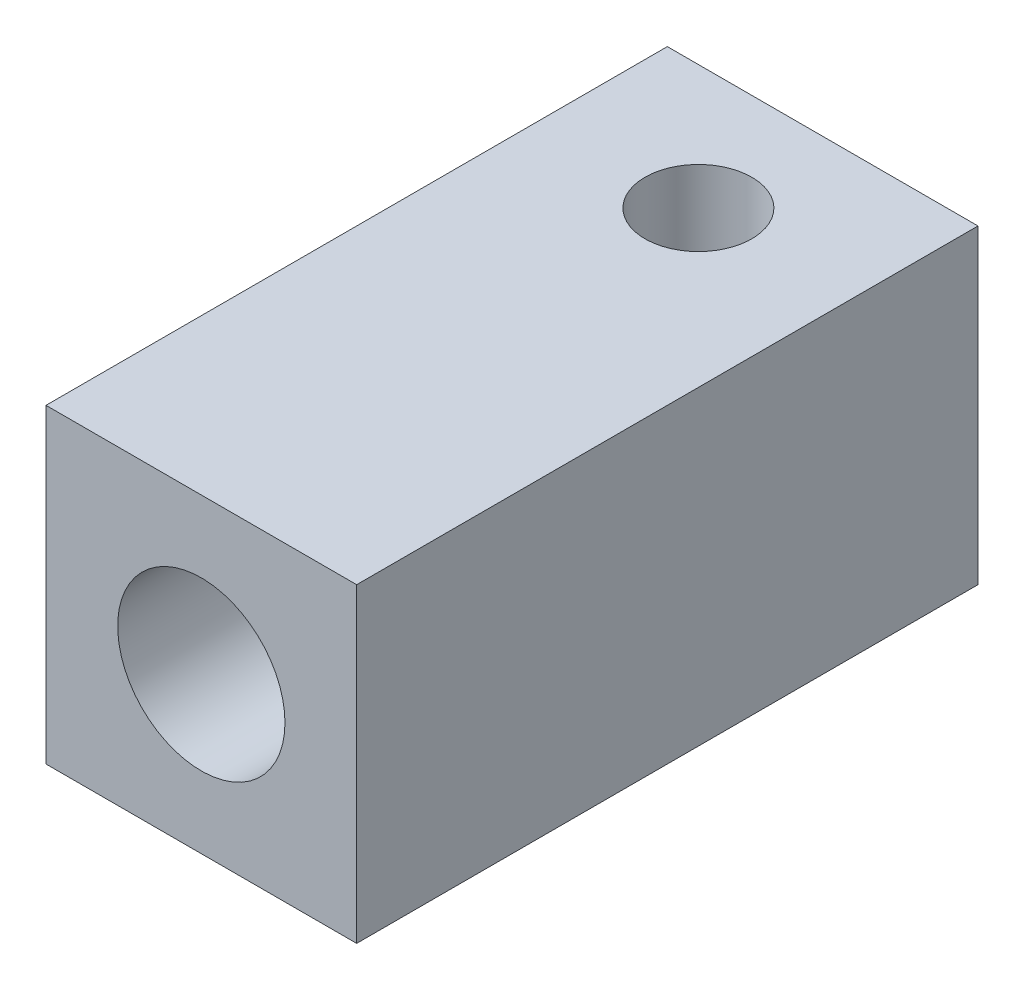
ISO-10303-21;
HEADER;
FILE_DESCRIPTION(('STEP AP214'),'2;1');
FILE_NAME('part.step','',(''),(''),'','','');
FILE_SCHEMA(('AUTOMOTIVE_DESIGN { 1 0 10303 214 1 1 1 1 }'));
ENDSEC;
DATA;
#1=APPLICATION_CONTEXT('core data for automotive mechanical design processes');
#2=APPLICATION_PROTOCOL_DEFINITION('international standard','automotive_design',2000,#1);
#3=PRODUCT_CONTEXT('',#1,'mechanical');
#4=PRODUCT('Part','Part','',(#3));
#5=PRODUCT_RELATED_PRODUCT_CATEGORY('part','',(#4));
#6=PRODUCT_DEFINITION_FORMATION('','',#4);
#7=PRODUCT_DEFINITION_CONTEXT('part definition',#1,'design');
#8=PRODUCT_DEFINITION('design','',#6,#7);
#9=PRODUCT_DEFINITION_SHAPE('','',#8);
#10=(LENGTH_UNIT() NAMED_UNIT(*) SI_UNIT(.MILLI.,.METRE.));
#11=(NAMED_UNIT(*) PLANE_ANGLE_UNIT() SI_UNIT($,.RADIAN.));
#12=(NAMED_UNIT(*) SI_UNIT($,.STERADIAN.) SOLID_ANGLE_UNIT());
#13=UNCERTAINTY_MEASURE_WITH_UNIT(LENGTH_MEASURE(1.E-05),#10,'distance_accuracy_value','');
#14=(GEOMETRIC_REPRESENTATION_CONTEXT(3) GLOBAL_UNCERTAINTY_ASSIGNED_CONTEXT((#13)) GLOBAL_UNIT_ASSIGNED_CONTEXT((#10,
#11,#12)) REPRESENTATION_CONTEXT('',''));
#15=CARTESIAN_POINT('',(0.,0.,0.));
#16=DIRECTION('',(0.,0.,1.));
#17=DIRECTION('',(1.,0.,0.));
#18=AXIS2_PLACEMENT_3D('',#15,#16,#17);
#19=CARTESIAN_POINT('',(-4.66304347826087,0.989130434782609,15.));
#20=DIRECTION('',(0.,0.,-1.));
#21=DIRECTION('',(-1.,0.,0.));
#22=AXIS2_PLACEMENT_3D('',#19,#20,#21);
#23=CYLINDRICAL_SURFACE('',#22,1.1);
#24=CARTESIAN_POINT('',(-4.66304347826087,0.989130434782609,0.));
#25=DIRECTION('',(0.,0.,-1.));
#26=DIRECTION('',(-1.,0.,0.));
#27=AXIS2_PLACEMENT_3D('',#24,#25,#26);
#28=CIRCLE('',#27,1.1);
#29=CARTESIAN_POINT('',(-5.76304347826087,0.989130434782609,0.));
#30=VERTEX_POINT('',#29);
#31=EDGE_CURVE('E102',#30,#30,#28,.T.);
#32=ORIENTED_EDGE('',*,*,#31,.T.);
#33=EDGE_LOOP('',(#32));
#34=FACE_BOUND('',#33,.T.);
#35=CARTESIAN_POINT('',(-4.66304347826087,0.989130434782609,7.5));
#36=DIRECTION('',(0.,0.,1.));
#37=DIRECTION('',(1.,0.,0.));
#38=AXIS2_PLACEMENT_3D('',#35,#36,#37);
#39=CIRCLE('',#38,1.1);
#40=CARTESIAN_POINT('',(-3.56304347826087,0.989130434782609,7.5));
#41=VERTEX_POINT('',#40);
#42=EDGE_CURVE('E37',#41,#41,#39,.F.);
#43=ORIENTED_EDGE('',*,*,#42,.F.);
#44=EDGE_LOOP('',(#43));
#45=FACE_BOUND('',#44,.T.);
#46=ADVANCED_FACE('F33',(#34,#45),#23,.F.);
#47=CARTESIAN_POINT('',(-8.41304347826087,4.73913043478261,15.));
#48=DIRECTION('',(1.,0.,0.));
#49=DIRECTION('',(0.,0.,-1.));
#50=AXIS2_PLACEMENT_3D('',#47,#48,#49);
#51=PLANE('',#50);
#52=DIRECTION('',(0.,-1.,0.));
#53=VECTOR('',#52,1.);
#54=CARTESIAN_POINT('',(-8.41304347826087,4.73913043478261,0.));
#55=LINE('',#54,#53);
#56=CARTESIAN_POINT('',(-8.41304347826087,4.73913043478261,0.));
#57=VERTEX_POINT('',#56);
#58=CARTESIAN_POINT('',(-8.41304347826087,-2.76086956521739,0.));
#59=VERTEX_POINT('',#58);
#60=EDGE_CURVE('E99',#57,#59,#55,.T.);
#61=ORIENTED_EDGE('',*,*,#60,.T.);
#62=DIRECTION('',(0.,0.,-1.));
#63=VECTOR('',#62,1.);
#64=CARTESIAN_POINT('',(-8.41304347826087,-2.76086956521739,15.));
#65=LINE('',#64,#63);
#66=CARTESIAN_POINT('',(-8.41304347826087,-2.76086956521739,15.));
#67=VERTEX_POINT('',#66);
#68=EDGE_CURVE('E11',#67,#59,#65,.T.);
#69=ORIENTED_EDGE('',*,*,#68,.F.);
#70=DIRECTION('',(0.,-1.,0.));
#71=VECTOR('',#70,1.);
#72=CARTESIAN_POINT('',(-8.41304347826087,4.73913043478261,15.));
#73=LINE('',#72,#71);
#74=CARTESIAN_POINT('',(-8.41304347826087,4.73913043478261,15.));
#75=VERTEX_POINT('',#74);
#76=EDGE_CURVE('E86',#75,#67,#73,.T.);
#77=ORIENTED_EDGE('',*,*,#76,.F.);
#78=DIRECTION('',(0.,0.,-1.));
#79=VECTOR('',#78,1.);
#80=CARTESIAN_POINT('',(-8.41304347826087,4.73913043478261,15.));
#81=LINE('',#80,#79);
#82=EDGE_CURVE('E95',#75,#57,#81,.T.);
#83=ORIENTED_EDGE('',*,*,#82,.T.);
#84=EDGE_LOOP('',(#61,#69,#77,#83));
#85=FACE_BOUND('',#84,.T.);
#86=ADVANCED_FACE('F35',(#85),#51,.F.);
#87=CARTESIAN_POINT('',(-8.41304347826087,-2.76086956521739,15.));
#88=DIRECTION('',(0.,1.,0.));
#89=DIRECTION('',(0.,0.,1.));
#90=AXIS2_PLACEMENT_3D('',#87,#88,#89);
#91=PLANE('',#90);
#92=DIRECTION('',(1.,0.,0.));
#93=VECTOR('',#92,1.);
#94=CARTESIAN_POINT('',(-8.41304347826087,-2.76086956521739,0.));
#95=LINE('',#94,#93);
#96=CARTESIAN_POINT('',(-0.913043478260869,-2.76086956521739,0.));
#97=VERTEX_POINT('',#96);
#98=EDGE_CURVE('E90',#59,#97,#95,.T.);
#99=ORIENTED_EDGE('',*,*,#98,.T.);
#100=DIRECTION('',(0.,0.,-1.));
#101=VECTOR('',#100,1.);
#102=CARTESIAN_POINT('',(-0.913043478260869,-2.76086956521739,15.));
#103=LINE('',#102,#101);
#104=CARTESIAN_POINT('',(-0.913043478260869,-2.76086956521739,15.));
#105=VERTEX_POINT('',#104);
#106=EDGE_CURVE('E43',#105,#97,#103,.T.);
#107=ORIENTED_EDGE('',*,*,#106,.F.);
#108=DIRECTION('',(1.,0.,0.));
#109=VECTOR('',#108,1.);
#110=CARTESIAN_POINT('',(-8.41304347826087,-2.76086956521739,15.));
#111=LINE('',#110,#109);
#112=EDGE_CURVE('E81',#67,#105,#111,.T.);
#113=ORIENTED_EDGE('',*,*,#112,.F.);
#114=ORIENTED_EDGE('',*,*,#68,.T.);
#115=EDGE_LOOP('',(#99,#107,#113,#114));
#116=FACE_BOUND('',#115,.T.);
#117=ADVANCED_FACE('F89',(#116),#91,.F.);
#118=CARTESIAN_POINT('',(-0.913043478260869,4.73913043478261,15.));
#119=DIRECTION('',(-1.,0.,0.));
#120=DIRECTION('',(0.,-1.,0.));
#121=AXIS2_PLACEMENT_3D('',#118,#119,#120);
#122=PLANE('',#121);
#123=DIRECTION('',(0.,1.,0.));
#124=VECTOR('',#123,1.);
#125=CARTESIAN_POINT('',(-0.913043478260869,4.73913043478261,0.));
#126=LINE('',#125,#124);
#127=CARTESIAN_POINT('',(-0.913043478260869,4.73913043478261,0.));
#128=VERTEX_POINT('',#127);
#129=EDGE_CURVE('E68',#97,#128,#126,.T.);
#130=ORIENTED_EDGE('',*,*,#129,.T.);
#131=DIRECTION('',(0.,0.,-1.));
#132=VECTOR('',#131,1.);
#133=CARTESIAN_POINT('',(-0.913043478260869,4.73913043478261,15.));
#134=LINE('',#133,#132);
#135=CARTESIAN_POINT('',(-0.913043478260869,4.73913043478261,15.));
#136=VERTEX_POINT('',#135);
#137=EDGE_CURVE('E91',#136,#128,#134,.T.);
#138=ORIENTED_EDGE('',*,*,#137,.F.);
#139=DIRECTION('',(0.,1.,0.));
#140=VECTOR('',#139,1.);
#141=CARTESIAN_POINT('',(-0.913043478260869,4.73913043478261,15.));
#142=LINE('',#141,#140);
#143=EDGE_CURVE('E84',#105,#136,#142,.T.);
#144=ORIENTED_EDGE('',*,*,#143,.F.);
#145=ORIENTED_EDGE('',*,*,#106,.T.);
#146=EDGE_LOOP('',(#130,#138,#144,#145));
#147=FACE_BOUND('',#146,.T.);
#148=ADVANCED_FACE('F93',(#147),#122,.F.);
#149=CARTESIAN_POINT('',(-8.41304347826087,4.73913043478261,15.));
#150=DIRECTION('',(0.,-1.,0.));
#151=DIRECTION('',(0.,0.,-1.));
#152=AXIS2_PLACEMENT_3D('',#149,#150,#151);
#153=PLANE('',#152);
#154=CARTESIAN_POINT('',(-4.66304347826087,4.73913043478261,3.));
#155=DIRECTION('',(0.,1.,0.));
#156=DIRECTION('',(-1.,0.,0.));
#157=AXIS2_PLACEMENT_3D('',#154,#155,#156);
#158=CIRCLE('',#157,1.28905);
#159=CARTESIAN_POINT('',(-5.95209347826087,4.73913043478261,3.));
#160=VERTEX_POINT('',#159);
#161=EDGE_CURVE('E122',#160,#160,#158,.T.);
#162=ORIENTED_EDGE('',*,*,#161,.F.);
#163=EDGE_LOOP('',(#162));
#164=FACE_BOUND('',#163,.T.);
#165=DIRECTION('',(-1.,0.,0.));
#166=VECTOR('',#165,1.);
#167=CARTESIAN_POINT('',(-8.41304347826087,4.73913043478261,0.));
#168=LINE('',#167,#166);
#169=EDGE_CURVE('E74',#128,#57,#168,.T.);
#170=ORIENTED_EDGE('',*,*,#169,.T.);
#171=ORIENTED_EDGE('',*,*,#82,.F.);
#172=DIRECTION('',(-1.,0.,0.));
#173=VECTOR('',#172,1.);
#174=CARTESIAN_POINT('',(-8.41304347826087,4.73913043478261,15.));
#175=LINE('',#174,#173);
#176=EDGE_CURVE('E51',#136,#75,#175,.T.);
#177=ORIENTED_EDGE('',*,*,#176,.F.);
#178=ORIENTED_EDGE('',*,*,#137,.T.);
#179=EDGE_LOOP('',(#170,#171,#177,#178));
#180=FACE_BOUND('',#179,.T.);
#181=ADVANCED_FACE('F107',(#164,#180),#153,.F.);
#182=CARTESIAN_POINT('',(0.,0.,15.));
#183=DIRECTION('',(0.,0.,1.));
#184=DIRECTION('',(1.,0.,0.));
#185=AXIS2_PLACEMENT_3D('',#182,#183,#184);
#186=PLANE('',#185);
#187=CARTESIAN_POINT('',(-4.66304347826087,0.989130434782609,15.));
#188=DIRECTION('',(0.,0.,1.));
#189=DIRECTION('',(1.,0.,0.));
#190=AXIS2_PLACEMENT_3D('',#187,#188,#189);
#191=CIRCLE('',#190,2.0193);
#192=CARTESIAN_POINT('',(-2.64374347826087,0.989130434782609,15.));
#193=VERTEX_POINT('',#192);
#194=EDGE_CURVE('E115',#193,#193,#191,.T.);
#195=ORIENTED_EDGE('',*,*,#194,.F.);
#196=EDGE_LOOP('',(#195));
#197=FACE_BOUND('',#196,.T.);
#198=ORIENTED_EDGE('',*,*,#76,.T.);
#199=ORIENTED_EDGE('',*,*,#112,.T.);
#200=ORIENTED_EDGE('',*,*,#143,.T.);
#201=ORIENTED_EDGE('',*,*,#176,.T.);
#202=EDGE_LOOP('',(#198,#199,#200,#201));
#203=FACE_BOUND('',#202,.T.);
#204=ADVANCED_FACE('F82',(#197,#203),#186,.T.);
#205=CARTESIAN_POINT('',(0.,0.,0.));
#206=DIRECTION('',(0.,0.,1.));
#207=DIRECTION('',(1.,0.,0.));
#208=AXIS2_PLACEMENT_3D('',#205,#206,#207);
#209=PLANE('',#208);
#210=ORIENTED_EDGE('',*,*,#31,.F.);
#211=EDGE_LOOP('',(#210));
#212=FACE_BOUND('',#211,.T.);
#213=ORIENTED_EDGE('',*,*,#60,.F.);
#214=ORIENTED_EDGE('',*,*,#169,.F.);
#215=ORIENTED_EDGE('',*,*,#129,.F.);
#216=ORIENTED_EDGE('',*,*,#98,.F.);
#217=EDGE_LOOP('',(#213,#214,#215,#216));
#218=FACE_BOUND('',#217,.T.);
#219=ADVANCED_FACE('F110',(#212,#218),#209,.F.);
#220=CARTESIAN_POINT('',(-4.66304347826087,0.989130434782609,7.5));
#221=DIRECTION('',(0.,0.,1.));
#222=DIRECTION('',(1.,0.,0.));
#223=AXIS2_PLACEMENT_3D('',#220,#221,#222);
#224=PLANE('',#223);
#225=CARTESIAN_POINT('',(-4.66304347826087,0.989130434782609,7.5));
#226=DIRECTION('',(0.,0.,1.));
#227=DIRECTION('',(1.,0.,0.));
#228=AXIS2_PLACEMENT_3D('',#225,#226,#227);
#229=CIRCLE('',#228,2.0193);
#230=CARTESIAN_POINT('',(-2.64374347826087,0.989130434782609,7.5));
#231=VERTEX_POINT('',#230);
#232=EDGE_CURVE('E118',#231,#231,#229,.T.);
#233=ORIENTED_EDGE('',*,*,#232,.T.);
#234=EDGE_LOOP('',(#233));
#235=FACE_BOUND('',#234,.T.);
#236=ORIENTED_EDGE('',*,*,#42,.T.);
#237=EDGE_LOOP('',(#236));
#238=FACE_BOUND('',#237,.T.);
#239=ADVANCED_FACE('F157',(#235,#238),#224,.T.);
#240=CARTESIAN_POINT('',(-4.66304347826087,0.989130434782609,7.5));
#241=DIRECTION('',(0.,0.,1.));
#242=DIRECTION('',(1.,0.,0.));
#243=AXIS2_PLACEMENT_3D('',#240,#241,#242);
#244=CYLINDRICAL_SURFACE('',#243,2.0193);
#245=ORIENTED_EDGE('',*,*,#232,.F.);
#246=EDGE_LOOP('',(#245));
#247=FACE_BOUND('',#246,.T.);
#248=ORIENTED_EDGE('',*,*,#194,.T.);
#249=EDGE_LOOP('',(#248));
#250=FACE_BOUND('',#249,.T.);
#251=ADVANCED_FACE('F133',(#247,#250),#244,.F.);
#252=CARTESIAN_POINT('',(-4.66304347826087,2.73913043478261,3.));
#253=DIRECTION('',(0.,1.,0.));
#254=DIRECTION('',(-1.,0.,0.));
#255=AXIS2_PLACEMENT_3D('',#252,#253,#254);
#256=CYLINDRICAL_SURFACE('',#255,1.28905);
#257=CARTESIAN_POINT('',(-4.66304347826087,2.73913043478261,3.));
#258=DIRECTION('',(0.,1.,0.));
#259=DIRECTION('',(-1.,0.,0.));
#260=AXIS2_PLACEMENT_3D('',#257,#258,#259);
#261=CIRCLE('',#260,1.28905);
#262=CARTESIAN_POINT('',(-5.95209347826087,2.73913043478261,3.));
#263=VERTEX_POINT('',#262);
#264=EDGE_CURVE('E119',#263,#263,#261,.T.);
#265=ORIENTED_EDGE('',*,*,#264,.F.);
#266=EDGE_LOOP('',(#265));
#267=FACE_BOUND('',#266,.T.);
#268=ORIENTED_EDGE('',*,*,#161,.T.);
#269=EDGE_LOOP('',(#268));
#270=FACE_BOUND('',#269,.T.);
#271=ADVANCED_FACE('F130',(#267,#270),#256,.F.);
#272=CARTESIAN_POINT('',(-4.66304347826087,2.73913043478261,3.));
#273=DIRECTION('',(0.,1.,0.));
#274=DIRECTION('',(-1.,0.,0.));
#275=AXIS2_PLACEMENT_3D('',#272,#273,#274);
#276=PLANE('',#275);
#277=ORIENTED_EDGE('',*,*,#264,.T.);
#278=EDGE_LOOP('',(#277));
#279=FACE_BOUND('',#278,.T.);
#280=ADVANCED_FACE('F128',(#279),#276,.T.);
#281=CLOSED_SHELL('',(#46,#86,#117,#148,#181,#204,#219,#239,#251,#271,#280));
#282=MANIFOLD_SOLID_BREP('B2',#281);
#283=ADVANCED_BREP_SHAPE_REPRESENTATION('',(#18,#282),#14);
#284=SHAPE_DEFINITION_REPRESENTATION(#9,#283);
ENDSEC;
END-ISO-10303-21;
